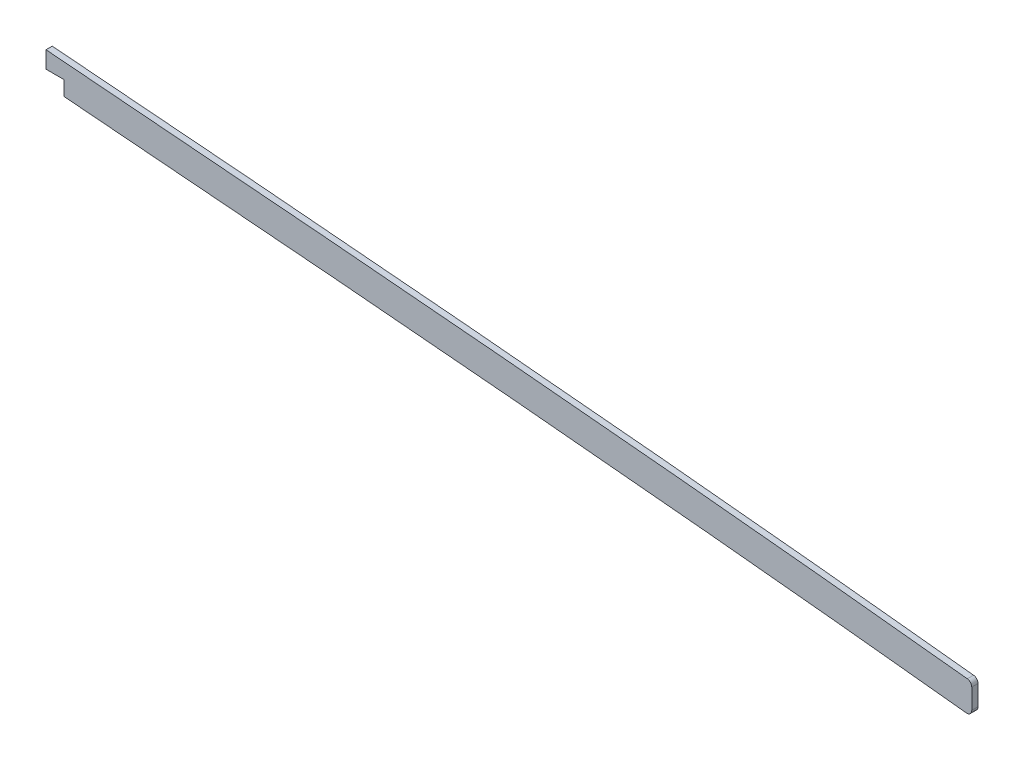
ISO-10303-21;
HEADER;
FILE_DESCRIPTION(('STEP AP214'),'2;1');
FILE_NAME('part.step','',(''),(''),'','','');
FILE_SCHEMA(('AUTOMOTIVE_DESIGN { 1 0 10303 214 1 1 1 1 }'));
ENDSEC;
DATA;
#1=APPLICATION_CONTEXT('core data for automotive mechanical design processes');
#2=APPLICATION_PROTOCOL_DEFINITION('international standard','automotive_design',2000,#1);
#3=PRODUCT_CONTEXT('',#1,'mechanical');
#4=PRODUCT('Part','Part','',(#3));
#5=PRODUCT_RELATED_PRODUCT_CATEGORY('part','',(#4));
#6=PRODUCT_DEFINITION_FORMATION('','',#4);
#7=PRODUCT_DEFINITION_CONTEXT('part definition',#1,'design');
#8=PRODUCT_DEFINITION('design','',#6,#7);
#9=PRODUCT_DEFINITION_SHAPE('','',#8);
#10=(LENGTH_UNIT() NAMED_UNIT(*) SI_UNIT(.MILLI.,.METRE.));
#11=(NAMED_UNIT(*) PLANE_ANGLE_UNIT() SI_UNIT($,.RADIAN.));
#12=(NAMED_UNIT(*) SI_UNIT($,.STERADIAN.) SOLID_ANGLE_UNIT());
#13=UNCERTAINTY_MEASURE_WITH_UNIT(LENGTH_MEASURE(1.E-05),#10,'distance_accuracy_value','');
#14=(GEOMETRIC_REPRESENTATION_CONTEXT(3) GLOBAL_UNCERTAINTY_ASSIGNED_CONTEXT((#13)) GLOBAL_UNIT_ASSIGNED_CONTEXT((#10,
#11,#12)) REPRESENTATION_CONTEXT('',''));
#15=CARTESIAN_POINT('',(0.,0.,0.));
#16=DIRECTION('',(0.,0.,1.));
#17=DIRECTION('',(1.,0.,0.));
#18=AXIS2_PLACEMENT_3D('',#15,#16,#17);
#19=CARTESIAN_POINT('',(816.035490090419,249.602504502473,1.5875));
#20=CARTESIAN_POINT('',(820.895958915978,248.948752998504,1.5875));
#21=CARTESIAN_POINT('',(830.611237516535,247.699685180795,1.5875));
#22=CARTESIAN_POINT('',(845.281067269815,245.953419482549,1.5875));
#23=CARTESIAN_POINT('',(860.086531547022,244.295598067093,1.5875));
#24=CARTESIAN_POINT('',(879.83070343434,242.186646027517,1.5875));
#25=CARTESIAN_POINT('',(904.36996709185,239.698279805688,1.5875));
#26=CARTESIAN_POINT('',(933.571022669327,236.832150625483,1.5875));
#27=CARTESIAN_POINT('',(962.642718040815,234.023667740898,1.5875));
#28=CARTESIAN_POINT('',(991.762593942944,231.241975908087,1.5875));
#29=CARTESIAN_POINT('',(1021.07201031471,228.475862291185,1.5875));
#30=CARTESIAN_POINT('',(1060.37643731472,224.796956681051,1.5875));
#31=CARTESIAN_POINT('',(1109.51301557685,220.18437886172,1.5875));
#32=CARTESIAN_POINT('',(1168.51119036116,214.817071985159,1.5875));
#33=CARTESIAN_POINT('',(1227.50012979269,209.662054041939,1.5875));
#34=CARTESIAN_POINT('',(1306.13316794657,203.021178328389,1.5875));
#35=CARTESIAN_POINT('',(1404.36147710547,194.920725932278,1.5875));
#36=CARTESIAN_POINT('',(1522.23985107062,184.918066624094,1.5875));
#37=CARTESIAN_POINT('',(1640.18285649102,175.16700778633,1.5875));
#38=CARTESIAN_POINT('',(1758.16535256682,165.7576394845,1.5875));
#39=CARTESIAN_POINT('',(1876.15538476943,156.590937078959,1.5875));
#40=CARTESIAN_POINT('',(1994.08749188002,147.453250142139,1.5875));
#41=CARTESIAN_POINT('',(2092.26869206097,139.624216053351,1.5875));
#42=CARTESIAN_POINT('',(2170.74802904205,133.07965672904,1.5875));
#43=CARTESIAN_POINT('',(2219.77173097685,128.842227835716,1.5875));
#44=CARTESIAN_POINT('',(2258.98398824696,125.347211495477,1.5875));
#45=CARTESIAN_POINT('',(2288.37945753647,122.670854497073,1.5875));
#46=CARTESIAN_POINT('',(2317.81224311603,119.931729386451,1.5875));
#47=CARTESIAN_POINT('',(2347.55150917161,117.100365282643,1.5875));
#48=CARTESIAN_POINT('',(2377.15989972739,114.210118529692,1.5875));
#49=CARTESIAN_POINT('',(2406.46965385077,111.268968010355,1.5875));
#50=CARTESIAN_POINT('',(2435.81832605954,108.240091266207,1.5875));
#51=CARTESIAN_POINT('',(2474.91392826886,104.090158094027,1.5875));
#52=CARTESIAN_POINT('',(2523.71623221738,98.6932837654834,1.5875));
#53=CARTESIAN_POINT('',(2582.04188116328,91.9122953054182,1.5875));
#54=CARTESIAN_POINT('',(2640.07521554125,84.8575618799937,1.5875));
#55=CARTESIAN_POINT('',(2678.57418525121,79.9813997136137,1.5875));
#56=CARTESIAN_POINT('',(2697.83785996013,77.4903351724698,1.5875));
#57=B_SPLINE_CURVE_WITH_KNOTS('',3,(#19,#20,#21,#22,#23,#24,#25,#26,#27,#28,#29,#30,#31,#32,#33,
#34,#35,#36,#37,#38,#39,#40,#41,#42,#43,#44,#45,#46,#47,#48,#49,#50,#51,#52,#53,#54,#55,#56),
.UNSPECIFIED.,.F.,.F.,(4,1,1,1,1,1,1,1,1,1,1,1,1,1,1,1,1,1,1,1,1,1,1,1,1,1,1,1,1,1,1,1,1,1,1,4),
(77.9308215150932,79.3861761032565,80.8415306914199,82.2968852795832,83.7522398677466,
86.6629490440732,89.5736582203999,92.4843673967266,95.3950765730532,98.3057857493799,
101.216494925707,107.03791327836,112.859331631013,118.680749983667,124.50216833632,
136.145005041627,147.787841746933,159.43067845224,171.073515157547,182.716351862853,
194.35918856816,206.002025273467,211.82344362612,217.644861978773,220.5555711551,
223.466280331427,226.376989507753,229.28769868408,232.198407860407,235.109117036733,
238.01982621306,240.930535389387,246.75195374204,252.573372094693,258.394790447347,264.2162088),.UNSPECIFIED.);
#58=DIRECTION('',(0.,0.,-1.));
#59=VECTOR('',#58,1.);
#60=SURFACE_OF_LINEAR_EXTRUSION('',#57,#59);
#61=DIRECTION('',(0.,0.,-1.));
#62=VECTOR('',#61,1.);
#63=CARTESIAN_POINT('',(2030.42896588334,144.537877355303,1.5875));
#64=LINE('',#63,#62);
#65=CARTESIAN_POINT('',(2030.42896588334,144.537877354903,-1.5875));
#66=VERTEX_POINT('',#65);
#67=CARTESIAN_POINT('',(2030.42896588334,144.537877354903,1.5875));
#68=VERTEX_POINT('',#67);
#69=EDGE_CURVE('E124',#66,#68,#64,.F.);
#70=ORIENTED_EDGE('',*,*,#69,.F.);
#71=CARTESIAN_POINT('',(816.035490090419,249.602504502473,-1.5875));
#72=CARTESIAN_POINT('',(820.895958915978,248.948752998504,-1.5875));
#73=CARTESIAN_POINT('',(830.611237516535,247.699685180795,-1.5875));
#74=CARTESIAN_POINT('',(845.281067269815,245.953419482549,-1.5875));
#75=CARTESIAN_POINT('',(860.086531547022,244.295598067093,-1.5875));
#76=CARTESIAN_POINT('',(879.83070343434,242.186646027517,-1.5875));
#77=CARTESIAN_POINT('',(904.36996709185,239.698279805688,-1.5875));
#78=CARTESIAN_POINT('',(933.571022669327,236.832150625483,-1.5875));
#79=CARTESIAN_POINT('',(962.642718040815,234.023667740898,-1.5875));
#80=CARTESIAN_POINT('',(991.762593942944,231.241975908087,-1.5875));
#81=CARTESIAN_POINT('',(1021.07201031471,228.475862291185,-1.5875));
#82=CARTESIAN_POINT('',(1060.37643731472,224.796956681051,-1.5875));
#83=CARTESIAN_POINT('',(1109.51301557685,220.18437886172,-1.5875));
#84=CARTESIAN_POINT('',(1168.51119036116,214.817071985159,-1.5875));
#85=CARTESIAN_POINT('',(1227.50012979269,209.662054041939,-1.5875));
#86=CARTESIAN_POINT('',(1306.13316794657,203.021178328389,-1.5875));
#87=CARTESIAN_POINT('',(1404.36147710547,194.920725932278,-1.5875));
#88=CARTESIAN_POINT('',(1522.23985107062,184.918066624094,-1.5875));
#89=CARTESIAN_POINT('',(1640.18285649102,175.16700778633,-1.5875));
#90=CARTESIAN_POINT('',(1758.16535256682,165.7576394845,-1.5875));
#91=CARTESIAN_POINT('',(1876.15538476943,156.590937078959,-1.5875));
#92=CARTESIAN_POINT('',(1994.08749188002,147.453250142139,-1.5875));
#93=CARTESIAN_POINT('',(2092.26869206097,139.624216053351,-1.5875));
#94=CARTESIAN_POINT('',(2170.74802904205,133.07965672904,-1.5875));
#95=CARTESIAN_POINT('',(2219.77173097685,128.842227835716,-1.5875));
#96=CARTESIAN_POINT('',(2258.98398824696,125.347211495477,-1.5875));
#97=CARTESIAN_POINT('',(2288.37945753647,122.670854497073,-1.5875));
#98=CARTESIAN_POINT('',(2317.81224311603,119.931729386451,-1.5875));
#99=CARTESIAN_POINT('',(2347.55150917161,117.100365282643,-1.5875));
#100=CARTESIAN_POINT('',(2377.15989972739,114.210118529692,-1.5875));
#101=CARTESIAN_POINT('',(2406.46965385077,111.268968010355,-1.5875));
#102=CARTESIAN_POINT('',(2435.81832605954,108.240091266207,-1.5875));
#103=CARTESIAN_POINT('',(2474.91392826886,104.090158094027,-1.5875));
#104=CARTESIAN_POINT('',(2523.71623221738,98.6932837654834,-1.5875));
#105=CARTESIAN_POINT('',(2582.04188116328,91.9122953054182,-1.5875));
#106=CARTESIAN_POINT('',(2640.07521554125,84.8575618799937,-1.5875));
#107=CARTESIAN_POINT('',(2678.57418525121,79.9813997136137,-1.5875));
#108=CARTESIAN_POINT('',(2697.83785996013,77.4903351724698,-1.5875));
#109=B_SPLINE_CURVE_WITH_KNOTS('',3,(#71,#72,#73,#74,#75,#76,#77,#78,#79,#80,#81,#82,#83,#84,
#85,#86,#87,#88,#89,#90,#91,#92,#93,#94,#95,#96,#97,#98,#99,#100,#101,#102,#103,#104,#105,#106,
#107,#108),.UNSPECIFIED.,.F.,.F.,(4,1,1,1,1,1,1,1,1,1,1,1,1,1,1,1,1,1,1,1,1,1,1,1,1,1,1,1,1,1,1,
1,1,1,1,4),(77.9308215150932,79.3861761032565,80.8415306914199,82.2968852795832,
83.7522398677466,86.6629490440732,89.5736582203999,92.4843673967266,95.3950765730532,
98.3057857493799,101.216494925707,107.03791327836,112.859331631013,118.680749983667,
124.50216833632,136.145005041627,147.787841746933,159.43067845224,171.073515157547,
182.716351862853,194.35918856816,206.002025273467,211.82344362612,217.644861978773,
220.5555711551,223.466280331427,226.376989507753,229.28769868408,232.198407860407,
235.109117036733,238.01982621306,240.930535389387,246.75195374204,252.573372094693,
258.394790447347,264.2162088),.UNSPECIFIED.);
#110=CARTESIAN_POINT('',(2488.92225842768,102.525212345132,-1.5875));
#111=VERTEX_POINT('',#110);
#112=EDGE_CURVE('E143',#66,#111,#109,.T.);
#113=ORIENTED_EDGE('',*,*,#112,.T.);
#114=DIRECTION('',(0.,0.,-1.));
#115=VECTOR('',#114,1.);
#116=CARTESIAN_POINT('',(2488.92225842768,102.525212345132,-1.5875));
#117=LINE('',#116,#115);
#118=CARTESIAN_POINT('',(2488.92225842768,102.525212345132,1.5875));
#119=VERTEX_POINT('',#118);
#120=EDGE_CURVE('E183',#111,#119,#117,.F.);
#121=ORIENTED_EDGE('',*,*,#120,.T.);
#122=EDGE_CURVE('E146',#68,#119,#57,.T.);
#123=ORIENTED_EDGE('',*,*,#122,.F.);
#124=EDGE_LOOP('',(#70,#113,#121,#123));
#125=FACE_BOUND('',#124,.T.);
#126=ADVANCED_FACE('F40',(#125),#60,.F.);
#127=CARTESIAN_POINT('',(2491.74,0.,1.5875));
#128=DIRECTION('',(1.,0.,0.));
#129=DIRECTION('',(0.,0.,-1.));
#130=AXIS2_PLACEMENT_3D('',#127,#128,#129);
#131=PLANE('',#130);
#132=DIRECTION('',(0.,-1.,0.));
#133=VECTOR('',#132,1.);
#134=CARTESIAN_POINT('',(2491.74,0.,1.5875));
#135=LINE('',#134,#133);
#136=CARTESIAN_POINT('',(2491.74,115.27129096741,1.5875));
#137=VERTEX_POINT('',#136);
#138=CARTESIAN_POINT('',(2491.74,105.049981566072,1.5875));
#139=VERTEX_POINT('',#138);
#140=EDGE_CURVE('E152',#137,#139,#135,.T.);
#141=ORIENTED_EDGE('',*,*,#140,.T.);
#142=DIRECTION('',(0.,0.,1.));
#143=VECTOR('',#142,1.);
#144=CARTESIAN_POINT('',(2491.74,105.049981566072,-1.5875));
#145=LINE('',#144,#143);
#146=CARTESIAN_POINT('',(2491.74,105.049981566072,-1.5875));
#147=VERTEX_POINT('',#146);
#148=EDGE_CURVE('E185',#139,#147,#145,.F.);
#149=ORIENTED_EDGE('',*,*,#148,.T.);
#150=DIRECTION('',(0.,-1.,0.));
#151=VECTOR('',#150,1.);
#152=CARTESIAN_POINT('',(2491.74,0.,-1.5875));
#153=LINE('',#152,#151);
#154=CARTESIAN_POINT('',(2491.74,115.27129096741,-1.5875));
#155=VERTEX_POINT('',#154);
#156=EDGE_CURVE('E250',#155,#147,#153,.T.);
#157=ORIENTED_EDGE('',*,*,#156,.F.);
#158=DIRECTION('',(0.,0.,-1.));
#159=VECTOR('',#158,1.);
#160=CARTESIAN_POINT('',(2491.74,115.27129096741,1.5875));
#161=LINE('',#160,#159);
#162=EDGE_CURVE('E259',#155,#137,#161,.F.);
#163=ORIENTED_EDGE('',*,*,#162,.T.);
#164=EDGE_LOOP('',(#141,#149,#157,#163));
#165=FACE_BOUND('',#164,.T.);
#166=ADVANCED_FACE('F164',(#165),#131,.T.);
#167=CARTESIAN_POINT('',(818.067033698442,264.706491743222,1.5875));
#168=CARTESIAN_POINT('',(827.043059883077,263.499182154688,1.5875));
#169=CARTESIAN_POINT('',(836.029088262746,262.37336018535,1.5875));
#170=CARTESIAN_POINT('',(845.086758911477,261.305822737124,1.5875));
#171=CARTESIAN_POINT('',(891.386485356828,256.087047064925,1.5875));
#172=CARTESIAN_POINT('',(937.686211733138,251.779150949417,1.5875));
#173=CARTESIAN_POINT('',(973.452075064018,248.227669424888,1.5875));
#174=CARTESIAN_POINT('',(1071.94667214103,239.051054037575,1.5875));
#175=CARTESIAN_POINT('',(1170.4412693194,229.731506737662,1.5875));
#176=CARTESIAN_POINT('',(1231.79194034372,224.503945812963,1.5875));
#177=CARTESIAN_POINT('',(1324.89933614602,216.790627817024,1.5875));
#178=CARTESIAN_POINT('',(1418.00673093479,209.040117977579,1.5875));
#179=CARTESIAN_POINT('',(1449.7429359212,206.361809936344,1.5875));
#180=CARTESIAN_POINT('',(1636.92860677809,190.521130341518,1.5875));
#181=CARTESIAN_POINT('',(1824.11427763497,175.409157235081,1.5875));
#182=CARTESIAN_POINT('',(1979.96694737597,164.299650252625,1.5875));
#183=CARTESIAN_POINT('',(2156.26863942885,150.414433314205,1.5875));
#184=CARTESIAN_POINT('',(2332.5703304682,133.85721640186,1.5875));
#185=CARTESIAN_POINT('',(2354.21298315715,131.785082220072,1.5875));
#186=CARTESIAN_POINT('',(2436.3555443117,123.723952135345,1.5875));
#187=CARTESIAN_POINT('',(2518.49810546626,114.859112916573,1.5875));
#188=CARTESIAN_POINT('',(2579.48130742255,107.74251493933,1.5875));
#189=CARTESIAN_POINT('',(2639.63682069028,100.383443901382,1.5875));
#190=CARTESIAN_POINT('',(2699.79233294449,92.6044886503654,1.5875));
#191=(BOUNDED_CURVE() B_SPLINE_CURVE(5,(#167,#168,#169,#170,#171,#172,#173,#174,#175,#176,#177,
#178,#179,#180,#181,#182,#183,#184,#185,#186,#187,#188,#189,#190),.UNSPECIFIED.,.F.,
.F.) B_SPLINE_CURVE_WITH_KNOTS((6,3,3,3,3,3,3,6),(77.9308215150932,82.46579272,100.7932901,
131.0989539,146.7691983,223.5339586,233.9431167,264.2162088),
.UNSPECIFIED.) CURVE() GEOMETRIC_REPRESENTATION_ITEM() RATIONAL_B_SPLINE_CURVE((1.,1.,1.,1.,1.,
1.,1.,1.,1.,1.,1.,1.,1.,1.,1.,1.,1.,1.,1.,1.,1.,1.,1.,1.)) REPRESENTATION_ITEM(''));
#192=DIRECTION('',(0.,0.,-1.));
#193=VECTOR('',#192,1.);
#194=SURFACE_OF_LINEAR_EXTRUSION('',#191,#193);
#195=DIRECTION('',(0.,0.,-1.));
#196=VECTOR('',#195,1.);
#197=CARTESIAN_POINT('',(2021.3026358767,160.549506885156,1.5875));
#198=LINE('',#197,#196);
#199=CARTESIAN_POINT('',(2021.3026358767,160.549150542046,1.5875));
#200=VERTEX_POINT('',#199);
#201=CARTESIAN_POINT('',(2021.30263587561,160.548972334283,-1.5875));
#202=VERTEX_POINT('',#201);
#203=EDGE_CURVE('E140',#200,#202,#198,.T.);
#204=ORIENTED_EDGE('',*,*,#203,.F.);
#205=CARTESIAN_POINT('',(2021.30266391472,160.549504665332,1.5875));
#206=CARTESIAN_POINT('',(2075.17843943586,156.284053788834,1.5875));
#207=CARTESIAN_POINT('',(2129.03339887979,151.932825044444,1.5875));
#208=CARTESIAN_POINT('',(2182.86135049328,147.435321774361,1.5875));
#209=CARTESIAN_POINT('',(2257.7158405721,140.887109415173,1.5875));
#210=CARTESIAN_POINT('',(2332.5703304682,133.85721640186,1.5875));
#211=CARTESIAN_POINT('',(2354.21298315715,131.785082220072,1.5875));
#212=CARTESIAN_POINT('',(2393.88802022809,127.891538721428,1.5875));
#213=CARTESIAN_POINT('',(2433.56305729903,123.810497020997,1.5875));
#214=CARTESIAN_POINT('',(2452.21666247466,121.847745257001,1.5875));
#215=CARTESIAN_POINT('',(2470.85747293873,119.84232705221,1.5875));
#216=CARTESIAN_POINT('',(2489.47746186636,117.796090942204,1.5875));
#217=(BOUNDED_CURVE() B_SPLINE_CURVE(5,(#205,#206,#207,#208,#209,#210,#211,#212,#213,#214,#215,
#216),.UNSPECIFIED.,.F.,.F.) B_SPLINE_CURVE_WITH_KNOTS((6,3,3,6),(196.930657230055,223.5339586,
233.9431167,243.183574610602),
.UNSPECIFIED.) CURVE() GEOMETRIC_REPRESENTATION_ITEM() RATIONAL_B_SPLINE_CURVE((1.,1.,1.,1.,1.,
1.,1.,1.,1.,1.,1.,1.)) REPRESENTATION_ITEM(''));
#218=CARTESIAN_POINT('',(2489.47746158466,117.796088378762,1.5875));
#219=VERTEX_POINT('',#218);
#220=EDGE_CURVE('E66',#200,#219,#217,.T.);
#221=ORIENTED_EDGE('',*,*,#220,.T.);
#222=DIRECTION('',(0.,0.,-1.));
#223=VECTOR('',#222,1.);
#224=CARTESIAN_POINT('',(2489.47746186633,117.796090942206,1.5875));
#225=LINE('',#224,#223);
#226=CARTESIAN_POINT('',(2489.47746158504,117.796088382214,-1.5875));
#227=VERTEX_POINT('',#226);
#228=EDGE_CURVE('E189',#219,#227,#225,.T.);
#229=ORIENTED_EDGE('',*,*,#228,.T.);
#230=CARTESIAN_POINT('',(2489.47746186637,117.796090942202,-1.5875));
#231=CARTESIAN_POINT('',(2470.85747293874,119.842327052209,-1.5875));
#232=CARTESIAN_POINT('',(2452.21666247466,121.847745257001,-1.5875));
#233=CARTESIAN_POINT('',(2433.56305729904,123.810497020996,-1.5875));
#234=CARTESIAN_POINT('',(2393.88802022809,127.891538721428,-1.5875));
#235=CARTESIAN_POINT('',(2354.21298315715,131.785082220072,-1.5875));
#236=CARTESIAN_POINT('',(2332.5703304682,133.85721640186,-1.5875));
#237=CARTESIAN_POINT('',(2257.71584057176,140.887109415204,-1.5875));
#238=CARTESIAN_POINT('',(2182.86135049262,147.435321774419,-1.5875));
#239=CARTESIAN_POINT('',(2129.03339887879,151.932825044528,-1.5875));
#240=CARTESIAN_POINT('',(2075.17843943453,156.284053788941,-1.5875));
#241=CARTESIAN_POINT('',(2021.30266391305,160.549504665463,-1.5875));
#242=(BOUNDED_CURVE() B_SPLINE_CURVE(5,(#230,#231,#232,#233,#234,#235,#236,#237,#238,#239,#240,
#241),.UNSPECIFIED.,.F.,.F.) B_SPLINE_CURVE_WITH_KNOTS((6,3,3,6),(196.930657229891,
206.171115140494,216.580273240494,243.183574610603),
.UNSPECIFIED.) CURVE() GEOMETRIC_REPRESENTATION_ITEM() RATIONAL_B_SPLINE_CURVE((1.,1.,1.,1.,1.,
1.,1.,1.,1.,1.,1.,1.)) REPRESENTATION_ITEM(''));
#243=EDGE_CURVE('E153',#202,#227,#242,.F.);
#244=ORIENTED_EDGE('',*,*,#243,.F.);
#245=EDGE_LOOP('',(#204,#221,#229,#244));
#246=FACE_BOUND('',#245,.T.);
#247=ADVANCED_FACE('F224',(#246),#194,.T.);
#248=CARTESIAN_POINT('',(0.,0.,1.5875));
#249=DIRECTION('',(0.,0.,1.));
#250=DIRECTION('',(1.,0.,0.));
#251=AXIS2_PLACEMENT_3D('',#248,#249,#250);
#252=PLANE('',#251);
#253=DIRECTION('',(0.,1.,0.));
#254=VECTOR('',#253,1.);
#255=CARTESIAN_POINT('',(2021.3026358767,160.549539386168,1.5875));
#256=LINE('',#255,#254);
#257=CARTESIAN_POINT('',(2021.3026358767,151.973195801504,1.5875));
#258=VERTEX_POINT('',#257);
#259=EDGE_CURVE('E118',#258,#200,#256,.T.);
#260=ORIENTED_EDGE('',*,*,#259,.F.);
#261=DIRECTION('',(1.,0.,0.));
#262=VECTOR('',#261,1.);
#263=CARTESIAN_POINT('',(2021.3026358767,151.973195801504,1.5875));
#264=LINE('',#263,#262);
#265=CARTESIAN_POINT('',(2030.42896588334,151.973195801504,1.5875));
#266=VERTEX_POINT('',#265);
#267=EDGE_CURVE('E112',#258,#266,#264,.T.);
#268=ORIENTED_EDGE('',*,*,#267,.T.);
#269=DIRECTION('',(0.,-1.,0.));
#270=VECTOR('',#269,1.);
#271=CARTESIAN_POINT('',(2030.42896588334,151.973195801504,1.5875));
#272=LINE('',#271,#270);
#273=EDGE_CURVE('E121',#266,#68,#272,.T.);
#274=ORIENTED_EDGE('',*,*,#273,.T.);
#275=ORIENTED_EDGE('',*,*,#122,.T.);
#276=CARTESIAN_POINT('',(2489.2,105.049981566072,1.5875));
#277=DIRECTION('',(0.,0.,1.));
#278=DIRECTION('',(1.,0.,0.));
#279=AXIS2_PLACEMENT_3D('',#276,#277,#278);
#280=CIRCLE('',#279,2.54);
#281=EDGE_CURVE('E181',#119,#139,#280,.T.);
#282=ORIENTED_EDGE('',*,*,#281,.T.);
#283=ORIENTED_EDGE('',*,*,#140,.F.);
#284=CARTESIAN_POINT('',(2489.2,115.27129096741,1.5875));
#285=DIRECTION('',(0.,0.,1.));
#286=DIRECTION('',(1.,0.,0.));
#287=AXIS2_PLACEMENT_3D('',#284,#285,#286);
#288=CIRCLE('',#287,2.54);
#289=EDGE_CURVE('E190',#137,#219,#288,.T.);
#290=ORIENTED_EDGE('',*,*,#289,.T.);
#291=ORIENTED_EDGE('',*,*,#220,.F.);
#292=EDGE_LOOP('',(#260,#268,#274,#275,#282,#283,#290,#291));
#293=FACE_BOUND('',#292,.T.);
#294=ADVANCED_FACE('F129',(#293),#252,.T.);
#295=CARTESIAN_POINT('',(0.,0.,-1.5875));
#296=DIRECTION('',(0.,0.,1.));
#297=DIRECTION('',(1.,0.,0.));
#298=AXIS2_PLACEMENT_3D('',#295,#296,#297);
#299=PLANE('',#298);
#300=DIRECTION('',(1.,0.,0.));
#301=VECTOR('',#300,1.);
#302=CARTESIAN_POINT('',(0.,151.973195801504,-1.5875));
#303=LINE('',#302,#301);
#304=CARTESIAN_POINT('',(2021.3026358767,151.973195801504,-1.5875));
#305=VERTEX_POINT('',#304);
#306=CARTESIAN_POINT('',(2030.42896588334,151.973195801504,-1.5875));
#307=VERTEX_POINT('',#306);
#308=EDGE_CURVE('E51',#305,#307,#303,.T.);
#309=ORIENTED_EDGE('',*,*,#308,.F.);
#310=DIRECTION('',(0.,1.,0.));
#311=VECTOR('',#310,1.);
#312=CARTESIAN_POINT('',(2021.3026358767,0.,-1.5875));
#313=LINE('',#312,#311);
#314=EDGE_CURVE('E11',#305,#202,#313,.T.);
#315=ORIENTED_EDGE('',*,*,#314,.T.);
#316=ORIENTED_EDGE('',*,*,#243,.T.);
#317=CARTESIAN_POINT('',(2489.2,115.27129096741,-1.5875));
#318=DIRECTION('',(0.,0.,1.));
#319=DIRECTION('',(1.,0.,0.));
#320=AXIS2_PLACEMENT_3D('',#317,#318,#319);
#321=CIRCLE('',#320,2.54);
#322=EDGE_CURVE('E264',#227,#155,#321,.F.);
#323=ORIENTED_EDGE('',*,*,#322,.T.);
#324=ORIENTED_EDGE('',*,*,#156,.T.);
#325=CARTESIAN_POINT('',(2489.2,105.049981566072,-1.5875));
#326=DIRECTION('',(0.,0.,1.));
#327=DIRECTION('',(1.,0.,0.));
#328=AXIS2_PLACEMENT_3D('',#325,#326,#327);
#329=CIRCLE('',#328,2.54);
#330=EDGE_CURVE('E248',#147,#111,#329,.F.);
#331=ORIENTED_EDGE('',*,*,#330,.T.);
#332=ORIENTED_EDGE('',*,*,#112,.F.);
#333=DIRECTION('',(0.,-1.,0.));
#334=VECTOR('',#333,1.);
#335=CARTESIAN_POINT('',(2030.42896588334,0.,-1.5875));
#336=LINE('',#335,#334);
#337=EDGE_CURVE('E194',#307,#66,#336,.T.);
#338=ORIENTED_EDGE('',*,*,#337,.F.);
#339=EDGE_LOOP('',(#309,#315,#316,#323,#324,#331,#332,#338));
#340=FACE_BOUND('',#339,.T.);
#341=ADVANCED_FACE('F169',(#340),#299,.F.);
#342=CARTESIAN_POINT('',(2489.2,105.049981566072,0.));
#343=DIRECTION('',(0.,0.,-1.));
#344=DIRECTION('',(-1.,0.,0.));
#345=AXIS2_PLACEMENT_3D('',#342,#343,#344);
#346=CYLINDRICAL_SURFACE('',#345,2.54);
#347=ORIENTED_EDGE('',*,*,#281,.F.);
#348=ORIENTED_EDGE('',*,*,#120,.F.);
#349=ORIENTED_EDGE('',*,*,#330,.F.);
#350=ORIENTED_EDGE('',*,*,#148,.F.);
#351=EDGE_LOOP('',(#347,#348,#349,#350));
#352=FACE_BOUND('',#351,.T.);
#353=ADVANCED_FACE('F167',(#352),#346,.T.);
#354=CARTESIAN_POINT('',(2489.2,115.27129096741,0.));
#355=DIRECTION('',(0.,0.,-1.));
#356=DIRECTION('',(-1.,0.,0.));
#357=AXIS2_PLACEMENT_3D('',#354,#355,#356);
#358=CYLINDRICAL_SURFACE('',#357,2.54);
#359=ORIENTED_EDGE('',*,*,#289,.F.);
#360=ORIENTED_EDGE('',*,*,#162,.F.);
#361=ORIENTED_EDGE('',*,*,#322,.F.);
#362=ORIENTED_EDGE('',*,*,#228,.F.);
#363=EDGE_LOOP('',(#359,#360,#361,#362));
#364=FACE_BOUND('',#363,.T.);
#365=ADVANCED_FACE('F42',(#364),#358,.T.);
#366=CARTESIAN_POINT('',(2021.3026358767,151.973195801504,-6.0325));
#367=DIRECTION('',(0.,-1.,0.));
#368=DIRECTION('',(0.,0.,-1.));
#369=AXIS2_PLACEMENT_3D('',#366,#367,#368);
#370=PLANE('',#369);
#371=ORIENTED_EDGE('',*,*,#308,.T.);
#372=DIRECTION('',(0.,0.,1.));
#373=VECTOR('',#372,1.);
#374=CARTESIAN_POINT('',(2030.42896588334,151.973195801504,-6.0325));
#375=LINE('',#374,#373);
#376=EDGE_CURVE('E59',#307,#266,#375,.T.);
#377=ORIENTED_EDGE('',*,*,#376,.T.);
#378=ORIENTED_EDGE('',*,*,#267,.F.);
#379=DIRECTION('',(0.,0.,1.));
#380=VECTOR('',#379,1.);
#381=CARTESIAN_POINT('',(2021.3026358767,151.973195801504,-6.0325));
#382=LINE('',#381,#380);
#383=EDGE_CURVE('E117',#305,#258,#382,.T.);
#384=ORIENTED_EDGE('',*,*,#383,.F.);
#385=EDGE_LOOP('',(#371,#377,#378,#384));
#386=FACE_BOUND('',#385,.T.);
#387=ADVANCED_FACE('F109',(#386),#370,.T.);
#388=CARTESIAN_POINT('',(2030.42896588334,151.973195801504,-6.0325));
#389=DIRECTION('',(-1.,0.,0.));
#390=DIRECTION('',(0.,0.,1.));
#391=AXIS2_PLACEMENT_3D('',#388,#389,#390);
#392=PLANE('',#391);
#393=ORIENTED_EDGE('',*,*,#69,.T.);
#394=ORIENTED_EDGE('',*,*,#273,.F.);
#395=ORIENTED_EDGE('',*,*,#376,.F.);
#396=ORIENTED_EDGE('',*,*,#337,.T.);
#397=EDGE_LOOP('',(#393,#394,#395,#396));
#398=FACE_BOUND('',#397,.T.);
#399=ADVANCED_FACE('F122',(#398),#392,.T.);
#400=CARTESIAN_POINT('',(2021.3026358767,160.549539386168,-6.0325));
#401=DIRECTION('',(1.,0.,0.));
#402=DIRECTION('',(0.,0.,-1.));
#403=AXIS2_PLACEMENT_3D('',#400,#401,#402);
#404=PLANE('',#403);
#405=ORIENTED_EDGE('',*,*,#203,.T.);
#406=ORIENTED_EDGE('',*,*,#314,.F.);
#407=ORIENTED_EDGE('',*,*,#383,.T.);
#408=ORIENTED_EDGE('',*,*,#259,.T.);
#409=EDGE_LOOP('',(#405,#406,#407,#408));
#410=FACE_BOUND('',#409,.T.);
#411=ADVANCED_FACE('F278',(#410),#404,.F.);
#412=CLOSED_SHELL('',(#126,#166,#247,#294,#341,#353,#365,#387,#399,#411));
#413=MANIFOLD_SOLID_BREP('B2',#412);
#414=ADVANCED_BREP_SHAPE_REPRESENTATION('',(#18,#413),#14);
#415=SHAPE_DEFINITION_REPRESENTATION(#9,#414);
ENDSEC;
END-ISO-10303-21;
